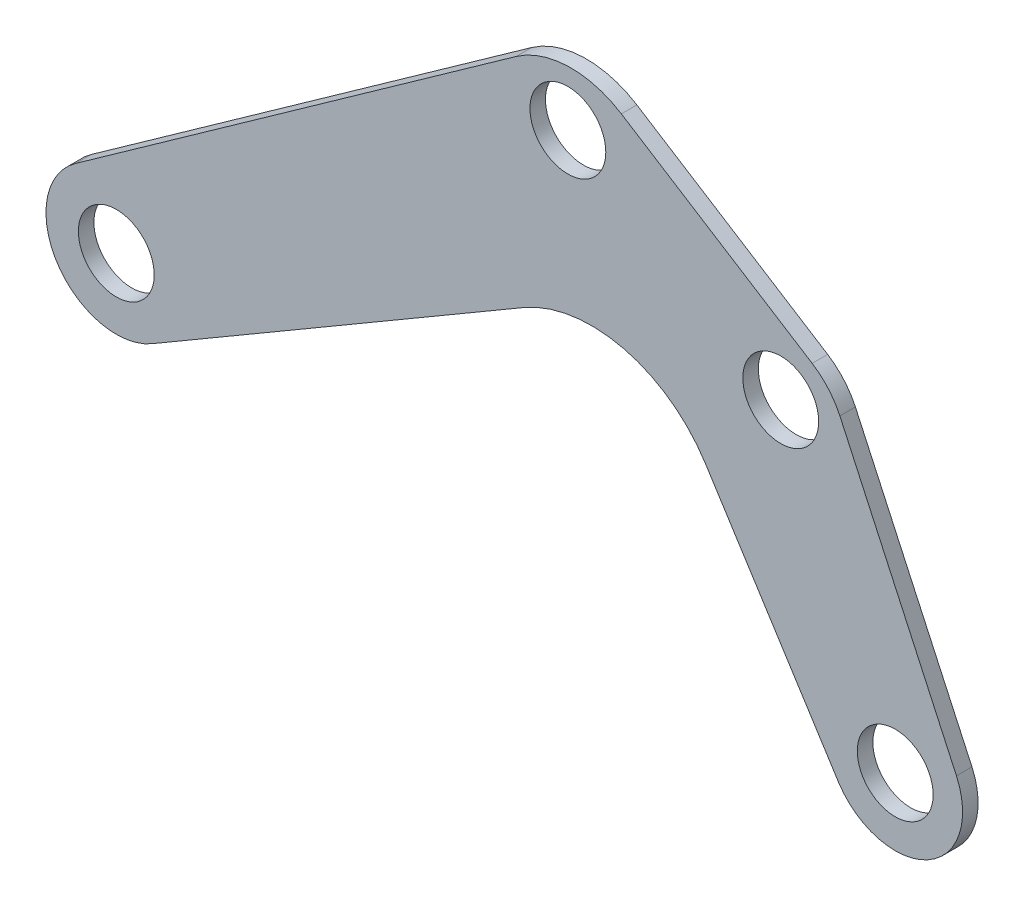
ISO-10303-21;
HEADER;
FILE_DESCRIPTION(('STEP AP214'),'2;1');
FILE_NAME('part.step','',(''),(''),'','','');
FILE_SCHEMA(('AUTOMOTIVE_DESIGN { 1 0 10303 214 1 1 1 1 }'));
ENDSEC;
DATA;
#1=APPLICATION_CONTEXT('core data for automotive mechanical design processes');
#2=APPLICATION_PROTOCOL_DEFINITION('international standard','automotive_design',2000,#1);
#3=PRODUCT_CONTEXT('',#1,'mechanical');
#4=PRODUCT('Part','Part','',(#3));
#5=PRODUCT_RELATED_PRODUCT_CATEGORY('part','',(#4));
#6=PRODUCT_DEFINITION_FORMATION('','',#4);
#7=PRODUCT_DEFINITION_CONTEXT('part definition',#1,'design');
#8=PRODUCT_DEFINITION('design','',#6,#7);
#9=PRODUCT_DEFINITION_SHAPE('','',#8);
#10=(LENGTH_UNIT() NAMED_UNIT(*) SI_UNIT(.MILLI.,.METRE.));
#11=(NAMED_UNIT(*) PLANE_ANGLE_UNIT() SI_UNIT($,.RADIAN.));
#12=(NAMED_UNIT(*) SI_UNIT($,.STERADIAN.) SOLID_ANGLE_UNIT());
#13=UNCERTAINTY_MEASURE_WITH_UNIT(LENGTH_MEASURE(1.E-05),#10,'distance_accuracy_value','');
#14=(GEOMETRIC_REPRESENTATION_CONTEXT(3) GLOBAL_UNCERTAINTY_ASSIGNED_CONTEXT((#13)) GLOBAL_UNIT_ASSIGNED_CONTEXT((#10,
#11,#12)) REPRESENTATION_CONTEXT('',''));
#15=CARTESIAN_POINT('',(0.,0.,0.));
#16=DIRECTION('',(0.,0.,1.));
#17=DIRECTION('',(1.,0.,0.));
#18=AXIS2_PLACEMENT_3D('',#15,#16,#17);
#19=CARTESIAN_POINT('',(-130.990896357706,174.67124709344,5.842));
#20=DIRECTION('',(0.534491426828253,0.845173896098962,0.));
#21=DIRECTION('',(-0.845173896098962,0.534491426828253,0.));
#22=AXIS2_PLACEMENT_3D('',#19,#20,#21);
#23=PLANE('',#22);
#24=DIRECTION('',(0.845173896098962,-0.534491426828253,0.));
#25=VECTOR('',#24,1.);
#26=CARTESIAN_POINT('',(-130.990896357706,174.67124709344,5.842));
#27=LINE('',#26,#25);
#28=CARTESIAN_POINT('',(-110.835012277432,161.924583607055,5.842));
#29=VERTEX_POINT('',#28);
#30=CARTESIAN_POINT('',(-38.9733261847592,116.478959563007,5.842));
#31=VERTEX_POINT('',#30);
#32=EDGE_CURVE('E128',#29,#31,#27,.T.);
#33=ORIENTED_EDGE('',*,*,#32,.T.);
#34=DIRECTION('',(0.,0.,-1.));
#35=VECTOR('',#34,1.);
#36=CARTESIAN_POINT('',(-38.9733261847592,116.478959563007,5.842));
#37=LINE('',#36,#35);
#38=CARTESIAN_POINT('',(-38.9733261847592,116.478959563007,0.));
#39=VERTEX_POINT('',#38);
#40=EDGE_CURVE('E205',#31,#39,#37,.T.);
#41=ORIENTED_EDGE('',*,*,#40,.T.);
#42=DIRECTION('',(0.845173896098962,-0.534491426828253,0.));
#43=VECTOR('',#42,1.);
#44=CARTESIAN_POINT('',(-130.990896357706,174.67124709344,0.));
#45=LINE('',#44,#43);
#46=CARTESIAN_POINT('',(-110.835012277432,161.924583607055,0.));
#47=VERTEX_POINT('',#46);
#48=EDGE_CURVE('E159',#47,#39,#45,.T.);
#49=ORIENTED_EDGE('',*,*,#48,.F.);
#50=DIRECTION('',(0.,0.,-1.));
#51=VECTOR('',#50,1.);
#52=CARTESIAN_POINT('',(-110.835012277432,161.924583607055,5.842));
#53=LINE('',#52,#51);
#54=EDGE_CURVE('E199',#47,#29,#53,.F.);
#55=ORIENTED_EDGE('',*,*,#54,.T.);
#56=EDGE_LOOP('',(#33,#41,#49,#55));
#57=FACE_BOUND('',#56,.T.);
#58=ADVANCED_FACE('F39',(#57),#23,.T.);
#59=CARTESIAN_POINT('',(-316.438578670385,42.949101239655,5.842));
#60=DIRECTION('',(-0.579080592664443,0.815270303150678,0.));
#61=DIRECTION('',(-0.815270303150678,-0.579080592664443,0.));
#62=AXIS2_PLACEMENT_3D('',#59,#60,#61);
#63=PLANE('',#62);
#64=DIRECTION('',(0.815270303150677,0.579080592664443,0.));
#65=VECTOR('',#64,1.);
#66=CARTESIAN_POINT('',(-316.438578670385,42.949101239655,5.842));
#67=LINE('',#66,#65);
#68=CARTESIAN_POINT('',(-316.438578670385,42.949101239655,5.842));
#69=VERTEX_POINT('',#68);
#70=CARTESIAN_POINT('',(-150.433633290592,160.861211841814,5.842));
#71=VERTEX_POINT('',#70);
#72=EDGE_CURVE('E137',#69,#71,#67,.T.);
#73=ORIENTED_EDGE('',*,*,#72,.T.);
#74=DIRECTION('',(0.,0.,-1.));
#75=VECTOR('',#74,1.);
#76=CARTESIAN_POINT('',(-150.433633290592,160.861211841814,5.842));
#77=LINE('',#76,#75);
#78=CARTESIAN_POINT('',(-150.433633290592,160.861211841814,0.));
#79=VERTEX_POINT('',#78);
#80=EDGE_CURVE('E186',#71,#79,#77,.T.);
#81=ORIENTED_EDGE('',*,*,#80,.T.);
#82=DIRECTION('',(0.815270303150677,0.579080592664443,0.));
#83=VECTOR('',#82,1.);
#84=CARTESIAN_POINT('',(-316.438578670385,42.949101239655,0.));
#85=LINE('',#84,#83);
#86=CARTESIAN_POINT('',(-316.438578670385,42.949101239655,0.));
#87=VERTEX_POINT('',#86);
#88=EDGE_CURVE('E179',#87,#79,#85,.T.);
#89=ORIENTED_EDGE('',*,*,#88,.F.);
#90=DIRECTION('',(0.,0.,-1.));
#91=VECTOR('',#90,1.);
#92=CARTESIAN_POINT('',(-316.438578670385,42.949101239655,5.842));
#93=LINE('',#92,#91);
#94=EDGE_CURVE('E183',#69,#87,#93,.T.);
#95=ORIENTED_EDGE('',*,*,#94,.F.);
#96=EDGE_LOOP('',(#73,#81,#89,#95));
#97=FACE_BOUND('',#96,.T.);
#98=ADVANCED_FACE('F305',(#97),#63,.T.);
#99=CARTESIAN_POINT('',(-301.089652100981,21.3647594001714,5.842));
#100=DIRECTION('',(0.,0.,-1.));
#101=DIRECTION('',(-1.,0.,0.));
#102=AXIS2_PLACEMENT_3D('',#99,#100,#101);
#103=CYLINDRICAL_SURFACE('',#102,26.4853423515087);
#104=CARTESIAN_POINT('',(-301.089652100981,21.3647594001714,0.));
#105=DIRECTION('',(0.,0.,-1.));
#106=DIRECTION('',(-1.,0.,0.));
#107=AXIS2_PLACEMENT_3D('',#104,#105,#106);
#108=CIRCLE('',#107,26.4853423515087);
#109=CARTESIAN_POINT('',(-287.729052218177,-1.50372831214191,0.));
#110=VERTEX_POINT('',#109);
#111=EDGE_CURVE('E175',#110,#87,#108,.T.);
#112=ORIENTED_EDGE('',*,*,#111,.F.);
#113=DIRECTION('',(0.,0.,-1.));
#114=VECTOR('',#113,1.);
#115=CARTESIAN_POINT('',(-287.729052218177,-1.50372831214191,5.842));
#116=LINE('',#115,#114);
#117=CARTESIAN_POINT('',(-287.729052218177,-1.50372831214191,5.842));
#118=VERTEX_POINT('',#117);
#119=EDGE_CURVE('E187',#118,#110,#116,.T.);
#120=ORIENTED_EDGE('',*,*,#119,.F.);
#121=CARTESIAN_POINT('',(-301.089652100981,21.3647594001714,5.842));
#122=DIRECTION('',(0.,0.,-1.));
#123=DIRECTION('',(-1.,0.,0.));
#124=AXIS2_PLACEMENT_3D('',#121,#122,#123);
#125=CIRCLE('',#124,26.4853423515087);
#126=EDGE_CURVE('E152',#118,#69,#125,.T.);
#127=ORIENTED_EDGE('',*,*,#126,.T.);
#128=ORIENTED_EDGE('',*,*,#94,.T.);
#129=EDGE_LOOP('',(#112,#120,#127,#128));
#130=FACE_BOUND('',#129,.T.);
#131=ADVANCED_FACE('F310',(#130),#103,.T.);
#132=CARTESIAN_POINT('',(-105.434059083686,104.999617888453,5.842));
#133=DIRECTION('',(0.504452602707004,-0.863439385030663,0.));
#134=DIRECTION('',(0.863439385030663,0.504452602707004,0.));
#135=AXIS2_PLACEMENT_3D('',#132,#133,#134);
#136=PLANE('',#135);
#137=DIRECTION('',(-0.863439385030663,-0.504452602707004,0.));
#138=VECTOR('',#137,1.);
#139=CARTESIAN_POINT('',(-105.434059083686,104.999617888453,0.));
#140=LINE('',#139,#138);
#141=CARTESIAN_POINT('',(-147.684692293393,80.3152656824218,0.));
#142=VERTEX_POINT('',#141);
#143=EDGE_CURVE('E172',#142,#110,#140,.T.);
#144=ORIENTED_EDGE('',*,*,#143,.F.);
#145=DIRECTION('',(0.,0.,-1.));
#146=VECTOR('',#145,1.);
#147=CARTESIAN_POINT('',(-147.684692293393,80.3152656824219,5.842));
#148=LINE('',#147,#146);
#149=CARTESIAN_POINT('',(-147.684692293393,80.3152656824218,5.842));
#150=VERTEX_POINT('',#149);
#151=EDGE_CURVE('E55',#142,#150,#148,.F.);
#152=ORIENTED_EDGE('',*,*,#151,.T.);
#153=DIRECTION('',(-0.863439385030663,-0.504452602707004,0.));
#154=VECTOR('',#153,1.);
#155=CARTESIAN_POINT('',(-105.434059083686,104.999617888453,5.842));
#156=LINE('',#155,#154);
#157=EDGE_CURVE('E146',#150,#118,#156,.T.);
#158=ORIENTED_EDGE('',*,*,#157,.T.);
#159=ORIENTED_EDGE('',*,*,#119,.T.);
#160=EDGE_LOOP('',(#144,#152,#158,#159));
#161=FACE_BOUND('',#160,.T.);
#162=ADVANCED_FACE('F327',(#161),#136,.T.);
#163=CARTESIAN_POINT('',(-105.434059083686,104.999617888453,5.842));
#164=DIRECTION('',(-0.843953775810929,-0.536415906078926,0.));
#165=DIRECTION('',(0.536415906078926,-0.84395377581093,0.));
#166=AXIS2_PLACEMENT_3D('',#163,#164,#165);
#167=PLANE('',#166);
#168=DIRECTION('',(-0.536415906078926,0.84395377581093,0.));
#169=VECTOR('',#168,1.);
#170=CARTESIAN_POINT('',(-105.434059083686,104.999617888453,5.842));
#171=LINE('',#170,#169);
#172=CARTESIAN_POINT('',(-28.9482537162321,-15.3370155041914,5.842));
#173=VERTEX_POINT('',#172);
#174=CARTESIAN_POINT('',(-79.1856482646819,63.7024729516736,5.842));
#175=VERTEX_POINT('',#174);
#176=EDGE_CURVE('E142',#173,#175,#171,.T.);
#177=ORIENTED_EDGE('',*,*,#176,.T.);
#178=DIRECTION('',(0.,0.,-1.));
#179=VECTOR('',#178,1.);
#180=CARTESIAN_POINT('',(-79.185648264682,63.7024729516736,0.));
#181=LINE('',#180,#179);
#182=CARTESIAN_POINT('',(-79.1856482646819,63.7024729516736,0.));
#183=VERTEX_POINT('',#182);
#184=EDGE_CURVE('E217',#175,#183,#181,.T.);
#185=ORIENTED_EDGE('',*,*,#184,.T.);
#186=DIRECTION('',(-0.536415906078926,0.84395377581093,0.));
#187=VECTOR('',#186,1.);
#188=CARTESIAN_POINT('',(-105.434059083686,104.999617888453,0.));
#189=LINE('',#188,#187);
#190=CARTESIAN_POINT('',(-28.9482537162321,-15.3370155041914,0.));
#191=VERTEX_POINT('',#190);
#192=EDGE_CURVE('E169',#191,#183,#189,.T.);
#193=ORIENTED_EDGE('',*,*,#192,.F.);
#194=DIRECTION('',(0.,0.,-1.));
#195=VECTOR('',#194,1.);
#196=CARTESIAN_POINT('',(-28.9482537162321,-15.3370155041914,5.842));
#197=LINE('',#196,#195);
#198=EDGE_CURVE('E136',#173,#191,#197,.T.);
#199=ORIENTED_EDGE('',*,*,#198,.F.);
#200=EDGE_LOOP('',(#177,#185,#193,#199));
#201=FACE_BOUND('',#200,.T.);
#202=ADVANCED_FACE('F226',(#201),#167,.T.);
#203=CARTESIAN_POINT('',(-7.67507653605649,-1.50372831214193,5.842));
#204=DIRECTION('',(0.,0.,-1.));
#205=DIRECTION('',(-1.,0.,0.));
#206=AXIS2_PLACEMENT_3D('',#203,#204,#205);
#207=CYLINDRICAL_SURFACE('',#206,25.3753404287876);
#208=CARTESIAN_POINT('',(-7.67507653605649,-1.50372831214193,0.));
#209=DIRECTION('',(0.,0.,-1.));
#210=DIRECTION('',(-1.,0.,0.));
#211=AXIS2_PLACEMENT_3D('',#208,#209,#210);
#212=CIRCLE('',#211,25.3753404287876);
#213=CARTESIAN_POINT('',(15.3782305653129,9.10065444060782,0.));
#214=VERTEX_POINT('',#213);
#215=EDGE_CURVE('E134',#214,#191,#212,.T.);
#216=ORIENTED_EDGE('',*,*,#215,.F.);
#217=DIRECTION('',(0.,0.,-1.));
#218=VECTOR('',#217,1.);
#219=CARTESIAN_POINT('',(15.3782305653129,9.10065444060782,5.842));
#220=LINE('',#219,#218);
#221=CARTESIAN_POINT('',(15.3782305653129,9.10065444060782,5.842));
#222=VERTEX_POINT('',#221);
#223=EDGE_CURVE('E119',#222,#214,#220,.T.);
#224=ORIENTED_EDGE('',*,*,#223,.F.);
#225=CARTESIAN_POINT('',(-7.67507653605649,-1.50372831214193,5.842));
#226=DIRECTION('',(0.,0.,-1.));
#227=DIRECTION('',(-1.,0.,0.));
#228=AXIS2_PLACEMENT_3D('',#225,#226,#227);
#229=CIRCLE('',#228,25.3753404287876);
#230=EDGE_CURVE('E127',#222,#173,#229,.T.);
#231=ORIENTED_EDGE('',*,*,#230,.T.);
#232=ORIENTED_EDGE('',*,*,#198,.T.);
#233=EDGE_LOOP('',(#216,#224,#231,#232));
#234=FACE_BOUND('',#233,.T.);
#235=ADVANCED_FACE('F132',(#234),#207,.T.);
#236=CARTESIAN_POINT('',(-31.981087973147,112.057039534836,5.842));
#237=DIRECTION('',(0.90849252509795,0.417901102943208,0.));
#238=DIRECTION('',(-0.417901102943208,0.908492525097951,0.));
#239=AXIS2_PLACEMENT_3D('',#236,#237,#238);
#240=PLANE('',#239);
#241=DIRECTION('',(0.417901102943208,-0.90849252509795,0.));
#242=VECTOR('',#241,1.);
#243=CARTESIAN_POINT('',(-31.981087973147,112.057039534836,0.));
#244=LINE('',#243,#242);
#245=CARTESIAN_POINT('',(-28.5237354991039,104.540957722236,0.));
#246=VERTEX_POINT('',#245);
#247=EDGE_CURVE('E163',#246,#214,#244,.T.);
#248=ORIENTED_EDGE('',*,*,#247,.F.);
#249=DIRECTION('',(0.,0.,-1.));
#250=VECTOR('',#249,1.);
#251=CARTESIAN_POINT('',(-28.5237354991039,104.540957722236,5.842));
#252=LINE('',#251,#250);
#253=CARTESIAN_POINT('',(-28.5237354991039,104.540957722236,5.842));
#254=VERTEX_POINT('',#253);
#255=EDGE_CURVE('E122',#246,#254,#252,.F.);
#256=ORIENTED_EDGE('',*,*,#255,.T.);
#257=DIRECTION('',(0.417901102943208,-0.90849252509795,0.));
#258=VECTOR('',#257,1.);
#259=CARTESIAN_POINT('',(-31.981087973147,112.057039534836,5.842));
#260=LINE('',#259,#258);
#261=EDGE_CURVE('E115',#254,#222,#260,.T.);
#262=ORIENTED_EDGE('',*,*,#261,.T.);
#263=ORIENTED_EDGE('',*,*,#223,.T.);
#264=EDGE_LOOP('',(#248,#256,#262,#263));
#265=FACE_BOUND('',#264,.T.);
#266=ADVANCED_FACE('F118',(#265),#240,.T.);
#267=CARTESIAN_POINT('',(-7.67507653605649,-1.50372831214193,5.842));
#268=DIRECTION('',(0.,0.,-1.));
#269=DIRECTION('',(-1.,0.,0.));
#270=AXIS2_PLACEMENT_3D('',#267,#268,#269);
#271=PLANE('',#270);
#272=CARTESIAN_POINT('',(-7.67507653605649,-1.50372831214193,5.842));
#273=DIRECTION('',(0.,0.,-1.));
#274=DIRECTION('',(1.,0.,0.));
#275=AXIS2_PLACEMENT_3D('',#272,#273,#274);
#276=CIRCLE('',#275,14.2875);
#277=CARTESIAN_POINT('',(6.61242346394352,-1.50372831214193,5.842));
#278=VERTEX_POINT('',#277);
#279=EDGE_CURVE('E261',#278,#278,#276,.T.);
#280=ORIENTED_EDGE('',*,*,#279,.T.);
#281=EDGE_LOOP('',(#280));
#282=FACE_BOUND('',#281,.T.);
#283=CARTESIAN_POINT('',(-50.8,98.679,5.842));
#284=DIRECTION('',(0.,0.,-1.));
#285=DIRECTION('',(1.,0.,0.));
#286=AXIS2_PLACEMENT_3D('',#283,#284,#285);
#287=CIRCLE('',#286,14.2875);
#288=CARTESIAN_POINT('',(-36.5125,98.679,5.842));
#289=VERTEX_POINT('',#288);
#290=EDGE_CURVE('E253',#289,#289,#287,.T.);
#291=ORIENTED_EDGE('',*,*,#290,.T.);
#292=EDGE_LOOP('',(#291));
#293=FACE_BOUND('',#292,.T.);
#294=CARTESIAN_POINT('',(-130.990896357706,146.510317071253,5.842));
#295=DIRECTION('',(0.,0.,-1.));
#296=DIRECTION('',(1.,0.,0.));
#297=AXIS2_PLACEMENT_3D('',#294,#295,#296);
#298=CIRCLE('',#297,14.2875);
#299=CARTESIAN_POINT('',(-116.703396357706,146.510317071253,5.842));
#300=VERTEX_POINT('',#299);
#301=EDGE_CURVE('E245',#300,#300,#298,.T.);
#302=ORIENTED_EDGE('',*,*,#301,.T.);
#303=EDGE_LOOP('',(#302));
#304=FACE_BOUND('',#303,.T.);
#305=CARTESIAN_POINT('',(-301.089652100981,21.3647594001714,5.842));
#306=DIRECTION('',(0.,0.,-1.));
#307=DIRECTION('',(1.,0.,0.));
#308=AXIS2_PLACEMENT_3D('',#305,#306,#307);
#309=CIRCLE('',#308,14.2875);
#310=CARTESIAN_POINT('',(-286.802152100981,21.3647594001714,5.842));
#311=VERTEX_POINT('',#310);
#312=EDGE_CURVE('E164',#311,#311,#309,.T.);
#313=ORIENTED_EDGE('',*,*,#312,.T.);
#314=EDGE_LOOP('',(#313));
#315=FACE_BOUND('',#314,.T.);
#316=ORIENTED_EDGE('',*,*,#261,.F.);
#317=CARTESIAN_POINT('',(-53.9070166503406,92.8648009060023,5.842));
#318=DIRECTION('',(0.,0.,-1.));
#319=DIRECTION('',(-1.,0.,0.));
#320=AXIS2_PLACEMENT_3D('',#317,#318,#319);
#321=CIRCLE('',#320,27.94);
#322=EDGE_CURVE('E214',#254,#31,#321,.F.);
#323=ORIENTED_EDGE('',*,*,#322,.T.);
#324=ORIENTED_EDGE('',*,*,#32,.F.);
#325=CARTESIAN_POINT('',(-129.841527415445,131.870199861776,5.842));
#326=DIRECTION('',(0.,0.,-1.));
#327=DIRECTION('',(-1.,0.,0.));
#328=AXIS2_PLACEMENT_3D('',#325,#326,#327);
#329=CIRCLE('',#328,35.56);
#330=EDGE_CURVE('E202',#29,#71,#329,.F.);
#331=ORIENTED_EDGE('',*,*,#330,.T.);
#332=ORIENTED_EDGE('',*,*,#72,.F.);
#333=ORIENTED_EDGE('',*,*,#126,.F.);
#334=ORIENTED_EDGE('',*,*,#157,.F.);
#335=CARTESIAN_POINT('',(-122.058500075877,36.4525449228642,5.842));
#336=DIRECTION('',(0.,0.,-1.));
#337=DIRECTION('',(-1.,0.,0.));
#338=AXIS2_PLACEMENT_3D('',#335,#336,#337);
#339=CIRCLE('',#338,50.8);
#340=EDGE_CURVE('E11',#150,#175,#339,.T.);
#341=ORIENTED_EDGE('',*,*,#340,.T.);
#342=ORIENTED_EDGE('',*,*,#176,.F.);
#343=ORIENTED_EDGE('',*,*,#230,.F.);
#344=EDGE_LOOP('',(#316,#323,#324,#331,#332,#333,#334,#341,#342,#343));
#345=FACE_BOUND('',#344,.T.);
#346=ADVANCED_FACE('F140',(#282,#293,#304,#315,#345),#271,.F.);
#347=CARTESIAN_POINT('',(-7.67507653605649,-1.50372831214193,0.));
#348=DIRECTION('',(0.,0.,-1.));
#349=DIRECTION('',(-1.,0.,0.));
#350=AXIS2_PLACEMENT_3D('',#347,#348,#349);
#351=PLANE('',#350);
#352=CARTESIAN_POINT('',(-7.67507653605649,-1.50372831214193,0.));
#353=DIRECTION('',(0.,0.,-1.));
#354=DIRECTION('',(1.,0.,0.));
#355=AXIS2_PLACEMENT_3D('',#352,#353,#354);
#356=CIRCLE('',#355,14.2875);
#357=CARTESIAN_POINT('',(6.61242346394352,-1.50372831214193,0.));
#358=VERTEX_POINT('',#357);
#359=EDGE_CURVE('E265',#358,#358,#356,.T.);
#360=ORIENTED_EDGE('',*,*,#359,.F.);
#361=EDGE_LOOP('',(#360));
#362=FACE_BOUND('',#361,.T.);
#363=CARTESIAN_POINT('',(-50.8,98.679,0.));
#364=DIRECTION('',(0.,0.,-1.));
#365=DIRECTION('',(1.,0.,0.));
#366=AXIS2_PLACEMENT_3D('',#363,#364,#365);
#367=CIRCLE('',#366,14.2875);
#368=CARTESIAN_POINT('',(-36.5125,98.679,0.));
#369=VERTEX_POINT('',#368);
#370=EDGE_CURVE('E257',#369,#369,#367,.T.);
#371=ORIENTED_EDGE('',*,*,#370,.F.);
#372=EDGE_LOOP('',(#371));
#373=FACE_BOUND('',#372,.T.);
#374=CARTESIAN_POINT('',(-130.990896357706,146.510317071253,0.));
#375=DIRECTION('',(0.,0.,-1.));
#376=DIRECTION('',(1.,0.,0.));
#377=AXIS2_PLACEMENT_3D('',#374,#375,#376);
#378=CIRCLE('',#377,14.2875);
#379=CARTESIAN_POINT('',(-116.703396357706,146.510317071253,0.));
#380=VERTEX_POINT('',#379);
#381=EDGE_CURVE('E249',#380,#380,#378,.T.);
#382=ORIENTED_EDGE('',*,*,#381,.F.);
#383=EDGE_LOOP('',(#382));
#384=FACE_BOUND('',#383,.T.);
#385=CARTESIAN_POINT('',(-301.089652100981,21.3647594001714,0.));
#386=DIRECTION('',(0.,0.,-1.));
#387=DIRECTION('',(1.,0.,0.));
#388=AXIS2_PLACEMENT_3D('',#385,#386,#387);
#389=CIRCLE('',#388,14.2875);
#390=CARTESIAN_POINT('',(-286.802152100981,21.3647594001714,0.));
#391=VERTEX_POINT('',#390);
#392=EDGE_CURVE('E241',#391,#391,#389,.T.);
#393=ORIENTED_EDGE('',*,*,#392,.F.);
#394=EDGE_LOOP('',(#393));
#395=FACE_BOUND('',#394,.T.);
#396=ORIENTED_EDGE('',*,*,#48,.T.);
#397=CARTESIAN_POINT('',(-53.9070166503406,92.8648009060023,0.));
#398=DIRECTION('',(0.,0.,-1.));
#399=DIRECTION('',(-1.,0.,0.));
#400=AXIS2_PLACEMENT_3D('',#397,#398,#399);
#401=CIRCLE('',#400,27.94);
#402=EDGE_CURVE('E209',#39,#246,#401,.T.);
#403=ORIENTED_EDGE('',*,*,#402,.T.);
#404=ORIENTED_EDGE('',*,*,#247,.T.);
#405=ORIENTED_EDGE('',*,*,#215,.T.);
#406=ORIENTED_EDGE('',*,*,#192,.T.);
#407=CARTESIAN_POINT('',(-122.058500075877,36.4525449228642,0.));
#408=DIRECTION('',(0.,0.,-1.));
#409=DIRECTION('',(-1.,0.,0.));
#410=AXIS2_PLACEMENT_3D('',#407,#408,#409);
#411=CIRCLE('',#410,50.8);
#412=EDGE_CURVE('E48',#183,#142,#411,.F.);
#413=ORIENTED_EDGE('',*,*,#412,.T.);
#414=ORIENTED_EDGE('',*,*,#143,.T.);
#415=ORIENTED_EDGE('',*,*,#111,.T.);
#416=ORIENTED_EDGE('',*,*,#88,.T.);
#417=CARTESIAN_POINT('',(-129.841527415445,131.870199861776,0.));
#418=DIRECTION('',(0.,0.,-1.));
#419=DIRECTION('',(-1.,0.,0.));
#420=AXIS2_PLACEMENT_3D('',#417,#418,#419);
#421=CIRCLE('',#420,35.56);
#422=EDGE_CURVE('E196',#79,#47,#421,.T.);
#423=ORIENTED_EDGE('',*,*,#422,.T.);
#424=EDGE_LOOP('',(#396,#403,#404,#405,#406,#413,#414,#415,#416,#423));
#425=FACE_BOUND('',#424,.T.);
#426=ADVANCED_FACE('F229',(#362,#373,#384,#395,#425),#351,.T.);
#427=CARTESIAN_POINT('',(-301.089652100981,21.3647594001714,5.842));
#428=DIRECTION('',(0.,0.,-1.));
#429=DIRECTION('',(-1.,0.,0.));
#430=AXIS2_PLACEMENT_3D('',#427,#428,#429);
#431=CYLINDRICAL_SURFACE('',#430,14.2875);
#432=ORIENTED_EDGE('',*,*,#312,.F.);
#433=EDGE_LOOP('',(#432));
#434=FACE_BOUND('',#433,.T.);
#435=ORIENTED_EDGE('',*,*,#392,.T.);
#436=EDGE_LOOP('',(#435));
#437=FACE_BOUND('',#436,.T.);
#438=ADVANCED_FACE('F285',(#434,#437),#431,.F.);
#439=CARTESIAN_POINT('',(-130.990896357706,146.510317071253,5.842));
#440=DIRECTION('',(0.,0.,-1.));
#441=DIRECTION('',(-1.,0.,0.));
#442=AXIS2_PLACEMENT_3D('',#439,#440,#441);
#443=CYLINDRICAL_SURFACE('',#442,14.2875);
#444=ORIENTED_EDGE('',*,*,#301,.F.);
#445=EDGE_LOOP('',(#444));
#446=FACE_BOUND('',#445,.T.);
#447=ORIENTED_EDGE('',*,*,#381,.T.);
#448=EDGE_LOOP('',(#447));
#449=FACE_BOUND('',#448,.T.);
#450=ADVANCED_FACE('F294',(#446,#449),#443,.F.);
#451=CARTESIAN_POINT('',(-50.8,98.679,5.842));
#452=DIRECTION('',(0.,0.,-1.));
#453=DIRECTION('',(-1.,0.,0.));
#454=AXIS2_PLACEMENT_3D('',#451,#452,#453);
#455=CYLINDRICAL_SURFACE('',#454,14.2875);
#456=ORIENTED_EDGE('',*,*,#290,.F.);
#457=EDGE_LOOP('',(#456));
#458=FACE_BOUND('',#457,.T.);
#459=ORIENTED_EDGE('',*,*,#370,.T.);
#460=EDGE_LOOP('',(#459));
#461=FACE_BOUND('',#460,.T.);
#462=ADVANCED_FACE('F279',(#458,#461),#455,.F.);
#463=CARTESIAN_POINT('',(-7.67507653605649,-1.50372831214193,5.842));
#464=DIRECTION('',(0.,0.,-1.));
#465=DIRECTION('',(-1.,0.,0.));
#466=AXIS2_PLACEMENT_3D('',#463,#464,#465);
#467=CYLINDRICAL_SURFACE('',#466,14.2875);
#468=ORIENTED_EDGE('',*,*,#279,.F.);
#469=EDGE_LOOP('',(#468));
#470=FACE_BOUND('',#469,.T.);
#471=ORIENTED_EDGE('',*,*,#359,.T.);
#472=EDGE_LOOP('',(#471));
#473=FACE_BOUND('',#472,.T.);
#474=ADVANCED_FACE('F275',(#470,#473),#467,.F.);
#475=CARTESIAN_POINT('',(-129.841527415445,131.870199861776,5.842));
#476=DIRECTION('',(0.,0.,-1.));
#477=DIRECTION('',(-1.,0.,0.));
#478=AXIS2_PLACEMENT_3D('',#475,#476,#477);
#479=CYLINDRICAL_SURFACE('',#478,35.56);
#480=ORIENTED_EDGE('',*,*,#330,.F.);
#481=ORIENTED_EDGE('',*,*,#54,.F.);
#482=ORIENTED_EDGE('',*,*,#422,.F.);
#483=ORIENTED_EDGE('',*,*,#80,.F.);
#484=EDGE_LOOP('',(#480,#481,#482,#483));
#485=FACE_BOUND('',#484,.T.);
#486=ADVANCED_FACE('F278',(#485),#479,.T.);
#487=CARTESIAN_POINT('',(-53.9070166503406,92.8648009060023,5.842));
#488=DIRECTION('',(0.,0.,-1.));
#489=DIRECTION('',(-1.,0.,0.));
#490=AXIS2_PLACEMENT_3D('',#487,#488,#489);
#491=CYLINDRICAL_SURFACE('',#490,27.94);
#492=ORIENTED_EDGE('',*,*,#322,.F.);
#493=ORIENTED_EDGE('',*,*,#255,.F.);
#494=ORIENTED_EDGE('',*,*,#402,.F.);
#495=ORIENTED_EDGE('',*,*,#40,.F.);
#496=EDGE_LOOP('',(#492,#493,#494,#495));
#497=FACE_BOUND('',#496,.T.);
#498=ADVANCED_FACE('F231',(#497),#491,.T.);
#499=CARTESIAN_POINT('',(-122.058500075877,36.4525449228642,5.842));
#500=DIRECTION('',(0.,0.,1.));
#501=DIRECTION('',(1.,0.,0.));
#502=AXIS2_PLACEMENT_3D('',#499,#500,#501);
#503=CYLINDRICAL_SURFACE('',#502,50.8);
#504=ORIENTED_EDGE('',*,*,#340,.F.);
#505=ORIENTED_EDGE('',*,*,#151,.F.);
#506=ORIENTED_EDGE('',*,*,#412,.F.);
#507=ORIENTED_EDGE('',*,*,#184,.F.);
#508=EDGE_LOOP('',(#504,#505,#506,#507));
#509=FACE_BOUND('',#508,.T.);
#510=ADVANCED_FACE('F41',(#509),#503,.F.);
#511=CLOSED_SHELL('',(#58,#98,#131,#162,#202,#235,#266,#346,#426,#438,#450,#462,#474,#486,#498,#510));
#512=MANIFOLD_SOLID_BREP('B2',#511);
#513=ADVANCED_BREP_SHAPE_REPRESENTATION('',(#18,#512),#14);
#514=SHAPE_DEFINITION_REPRESENTATION(#9,#513);
ENDSEC;
END-ISO-10303-21;
